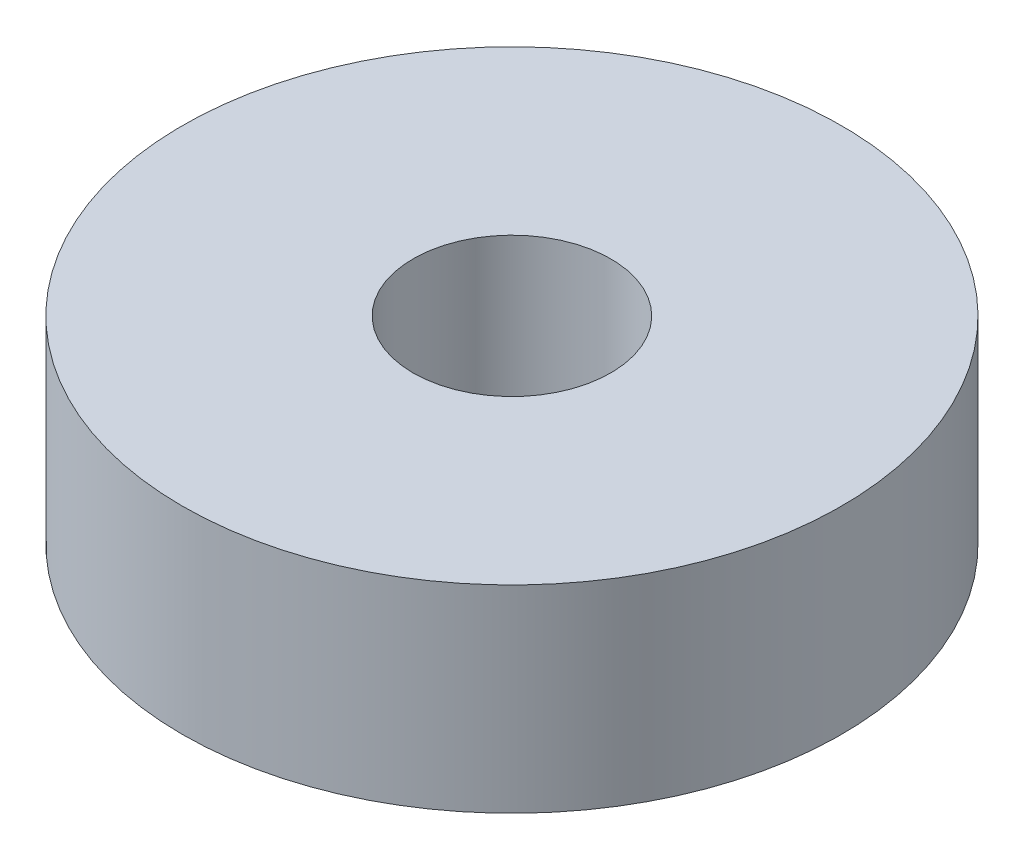
ISO-10303-21;
HEADER;
FILE_DESCRIPTION(('STEP AP214'),'2;1');
FILE_NAME('part.step','',(''),(''),'','','');
FILE_SCHEMA(('AUTOMOTIVE_DESIGN { 1 0 10303 214 1 1 1 1 }'));
ENDSEC;
DATA;
#1=APPLICATION_CONTEXT('core data for automotive mechanical design processes');
#2=APPLICATION_PROTOCOL_DEFINITION('international standard','automotive_design',2000,#1);
#3=PRODUCT_CONTEXT('',#1,'mechanical');
#4=PRODUCT('Part','Part','',(#3));
#5=PRODUCT_RELATED_PRODUCT_CATEGORY('part','',(#4));
#6=PRODUCT_DEFINITION_FORMATION('','',#4);
#7=PRODUCT_DEFINITION_CONTEXT('part definition',#1,'design');
#8=PRODUCT_DEFINITION('design','',#6,#7);
#9=PRODUCT_DEFINITION_SHAPE('','',#8);
#10=(LENGTH_UNIT() NAMED_UNIT(*) SI_UNIT(.MILLI.,.METRE.));
#11=(NAMED_UNIT(*) PLANE_ANGLE_UNIT() SI_UNIT($,.RADIAN.));
#12=(NAMED_UNIT(*) SI_UNIT($,.STERADIAN.) SOLID_ANGLE_UNIT());
#13=UNCERTAINTY_MEASURE_WITH_UNIT(LENGTH_MEASURE(1.E-05),#10,'distance_accuracy_value','');
#14=(GEOMETRIC_REPRESENTATION_CONTEXT(3) GLOBAL_UNCERTAINTY_ASSIGNED_CONTEXT((#13)) GLOBAL_UNIT_ASSIGNED_CONTEXT((#10,
#11,#12)) REPRESENTATION_CONTEXT('',''));
#15=CARTESIAN_POINT('',(0.,0.,0.));
#16=DIRECTION('',(0.,0.,1.));
#17=DIRECTION('',(1.,0.,0.));
#18=AXIS2_PLACEMENT_3D('',#15,#16,#17);
#19=CARTESIAN_POINT('',(0.,3.,0.));
#20=DIRECTION('',(0.,1.,0.));
#21=DIRECTION('',(0.,0.,1.));
#22=AXIS2_PLACEMENT_3D('',#19,#20,#21);
#23=PLANE('',#22);
#24=CARTESIAN_POINT('',(0.,3.,0.));
#25=DIRECTION('',(0.,1.,0.));
#26=DIRECTION('',(0.,0.,1.));
#27=AXIS2_PLACEMENT_3D('',#24,#25,#26);
#28=CIRCLE('',#27,5.);
#29=CARTESIAN_POINT('',(0.,3.,5.));
#30=VERTEX_POINT('',#29);
#31=EDGE_CURVE('E10',#30,#30,#28,.T.);
#32=ORIENTED_EDGE('',*,*,#31,.T.);
#33=EDGE_LOOP('',(#32));
#34=FACE_BOUND('',#33,.T.);
#35=CARTESIAN_POINT('',(0.,3.,0.));
#36=DIRECTION('',(0.,1.,0.));
#37=DIRECTION('',(0.,0.,1.));
#38=AXIS2_PLACEMENT_3D('',#35,#36,#37);
#39=CIRCLE('',#38,1.5);
#40=CARTESIAN_POINT('',(0.,3.,1.5));
#41=VERTEX_POINT('',#40);
#42=EDGE_CURVE('E44',#41,#41,#39,.T.);
#43=ORIENTED_EDGE('',*,*,#42,.F.);
#44=EDGE_LOOP('',(#43));
#45=FACE_BOUND('',#44,.T.);
#46=ADVANCED_FACE('F33',(#34,#45),#23,.T.);
#47=CARTESIAN_POINT('',(0.,0.,0.));
#48=DIRECTION('',(0.,1.,0.));
#49=DIRECTION('',(0.,0.,1.));
#50=AXIS2_PLACEMENT_3D('',#47,#48,#49);
#51=PLANE('',#50);
#52=CARTESIAN_POINT('',(0.,0.,0.));
#53=DIRECTION('',(0.,1.,0.));
#54=DIRECTION('',(0.,0.,1.));
#55=AXIS2_PLACEMENT_3D('',#52,#53,#54);
#56=CIRCLE('',#55,5.);
#57=CARTESIAN_POINT('',(0.,0.,5.));
#58=VERTEX_POINT('',#57);
#59=EDGE_CURVE('E37',#58,#58,#56,.T.);
#60=ORIENTED_EDGE('',*,*,#59,.F.);
#61=EDGE_LOOP('',(#60));
#62=FACE_BOUND('',#61,.T.);
#63=CARTESIAN_POINT('',(0.,0.,0.));
#64=DIRECTION('',(0.,1.,0.));
#65=DIRECTION('',(0.,0.,1.));
#66=AXIS2_PLACEMENT_3D('',#63,#64,#65);
#67=CIRCLE('',#66,1.5);
#68=CARTESIAN_POINT('',(0.,0.,1.5));
#69=VERTEX_POINT('',#68);
#70=EDGE_CURVE('E46',#69,#69,#67,.T.);
#71=ORIENTED_EDGE('',*,*,#70,.T.);
#72=EDGE_LOOP('',(#71));
#73=FACE_BOUND('',#72,.T.);
#74=ADVANCED_FACE('F56',(#62,#73),#51,.F.);
#75=CARTESIAN_POINT('',(0.,3.,0.));
#76=DIRECTION('',(0.,-1.,0.));
#77=DIRECTION('',(0.,0.,-1.));
#78=AXIS2_PLACEMENT_3D('',#75,#76,#77);
#79=CYLINDRICAL_SURFACE('',#78,5.);
#80=ORIENTED_EDGE('',*,*,#31,.F.);
#81=EDGE_LOOP('',(#80));
#82=FACE_BOUND('',#81,.T.);
#83=ORIENTED_EDGE('',*,*,#59,.T.);
#84=EDGE_LOOP('',(#83));
#85=FACE_BOUND('',#84,.T.);
#86=ADVANCED_FACE('F35',(#82,#85),#79,.T.);
#87=CARTESIAN_POINT('',(0.,3.,0.));
#88=DIRECTION('',(0.,-1.,0.));
#89=DIRECTION('',(0.,0.,-1.));
#90=AXIS2_PLACEMENT_3D('',#87,#88,#89);
#91=CYLINDRICAL_SURFACE('',#90,1.5);
#92=ORIENTED_EDGE('',*,*,#42,.T.);
#93=EDGE_LOOP('',(#92));
#94=FACE_BOUND('',#93,.T.);
#95=ORIENTED_EDGE('',*,*,#70,.F.);
#96=EDGE_LOOP('',(#95));
#97=FACE_BOUND('',#96,.T.);
#98=ADVANCED_FACE('F52',(#94,#97),#91,.F.);
#99=CLOSED_SHELL('',(#46,#74,#86,#98));
#100=MANIFOLD_SOLID_BREP('B2',#99);
#101=ADVANCED_BREP_SHAPE_REPRESENTATION('',(#18,#100),#14);
#102=SHAPE_DEFINITION_REPRESENTATION(#9,#101);
ENDSEC;
END-ISO-10303-21;
